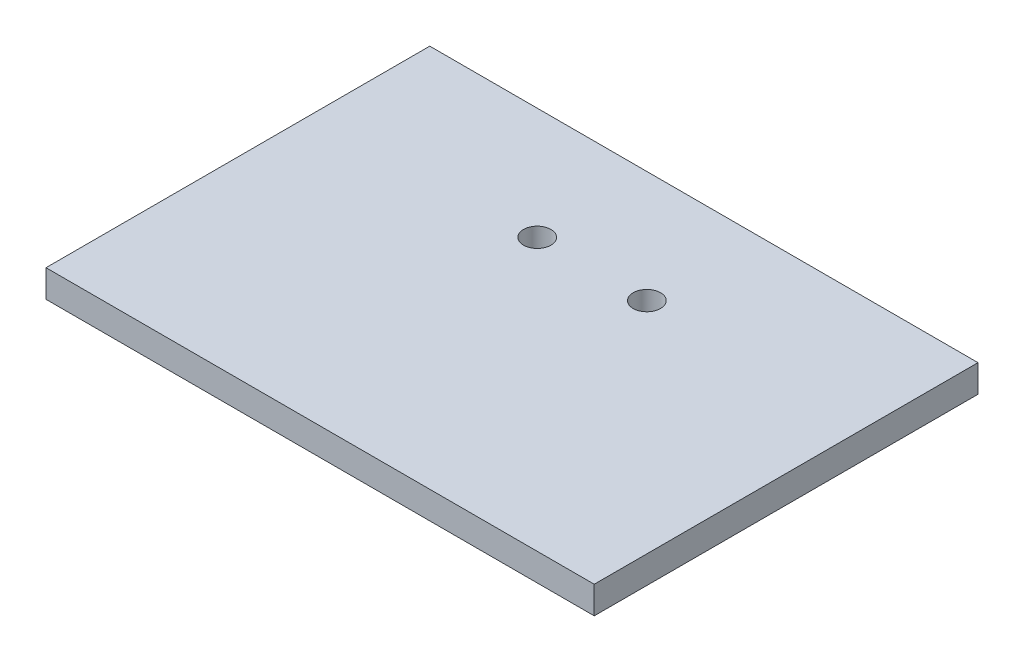
ISO-10303-21;
HEADER;
FILE_DESCRIPTION(('STEP AP214'),'2;1');
FILE_NAME('part.step','',(''),(''),'','','');
FILE_SCHEMA(('AUTOMOTIVE_DESIGN { 1 0 10303 214 1 1 1 1 }'));
ENDSEC;
DATA;
#1=APPLICATION_CONTEXT('core data for automotive mechanical design processes');
#2=APPLICATION_PROTOCOL_DEFINITION('international standard','automotive_design',2000,#1);
#3=PRODUCT_CONTEXT('',#1,'mechanical');
#4=PRODUCT('Part','Part','',(#3));
#5=PRODUCT_RELATED_PRODUCT_CATEGORY('part','',(#4));
#6=PRODUCT_DEFINITION_FORMATION('','',#4);
#7=PRODUCT_DEFINITION_CONTEXT('part definition',#1,'design');
#8=PRODUCT_DEFINITION('design','',#6,#7);
#9=PRODUCT_DEFINITION_SHAPE('','',#8);
#10=(LENGTH_UNIT() NAMED_UNIT(*) SI_UNIT(.MILLI.,.METRE.));
#11=(NAMED_UNIT(*) PLANE_ANGLE_UNIT() SI_UNIT($,.RADIAN.));
#12=(NAMED_UNIT(*) SI_UNIT($,.STERADIAN.) SOLID_ANGLE_UNIT());
#13=UNCERTAINTY_MEASURE_WITH_UNIT(LENGTH_MEASURE(1.E-05),#10,'distance_accuracy_value','');
#14=(GEOMETRIC_REPRESENTATION_CONTEXT(3) GLOBAL_UNCERTAINTY_ASSIGNED_CONTEXT((#13)) GLOBAL_UNIT_ASSIGNED_CONTEXT((#10,
#11,#12)) REPRESENTATION_CONTEXT('',''));
#15=CARTESIAN_POINT('',(0.,0.,0.));
#16=DIRECTION('',(0.,0.,1.));
#17=DIRECTION('',(1.,0.,0.));
#18=AXIS2_PLACEMENT_3D('',#15,#16,#17);
#19=CARTESIAN_POINT('',(0.,0.,44.45));
#20=DIRECTION('',(1.,0.,0.));
#21=DIRECTION('',(0.,0.,-1.));
#22=AXIS2_PLACEMENT_3D('',#19,#20,#21);
#23=PLANE('',#22);
#24=DIRECTION('',(0.,-1.,0.));
#25=VECTOR('',#24,1.);
#26=CARTESIAN_POINT('',(0.,0.,0.));
#27=LINE('',#26,#25);
#28=CARTESIAN_POINT('',(0.,3.175,0.));
#29=VERTEX_POINT('',#28);
#30=CARTESIAN_POINT('',(0.,0.,0.));
#31=VERTEX_POINT('',#30);
#32=EDGE_CURVE('E96',#29,#31,#27,.T.);
#33=ORIENTED_EDGE('',*,*,#32,.T.);
#34=DIRECTION('',(0.,0.,-1.));
#35=VECTOR('',#34,1.);
#36=CARTESIAN_POINT('',(0.,0.,44.45));
#37=LINE('',#36,#35);
#38=CARTESIAN_POINT('',(0.,0.,44.45));
#39=VERTEX_POINT('',#38);
#40=EDGE_CURVE('E11',#39,#31,#37,.T.);
#41=ORIENTED_EDGE('',*,*,#40,.F.);
#42=DIRECTION('',(0.,-1.,0.));
#43=VECTOR('',#42,1.);
#44=CARTESIAN_POINT('',(0.,0.,44.45));
#45=LINE('',#44,#43);
#46=CARTESIAN_POINT('',(0.,3.175,44.45));
#47=VERTEX_POINT('',#46);
#48=EDGE_CURVE('E84',#47,#39,#45,.T.);
#49=ORIENTED_EDGE('',*,*,#48,.F.);
#50=DIRECTION('',(0.,0.,-1.));
#51=VECTOR('',#50,1.);
#52=CARTESIAN_POINT('',(0.,3.175,44.45));
#53=LINE('',#52,#51);
#54=EDGE_CURVE('E92',#47,#29,#53,.T.);
#55=ORIENTED_EDGE('',*,*,#54,.T.);
#56=EDGE_LOOP('',(#33,#41,#49,#55));
#57=FACE_BOUND('',#56,.T.);
#58=ADVANCED_FACE('F33',(#57),#23,.F.);
#59=CARTESIAN_POINT('',(0.,0.,44.45));
#60=DIRECTION('',(0.,1.,0.));
#61=DIRECTION('',(0.,0.,1.));
#62=AXIS2_PLACEMENT_3D('',#59,#60,#61);
#63=PLANE('',#62);
#64=CARTESIAN_POINT('',(38.1,0.,12.954));
#65=DIRECTION('',(0.,1.,0.));
#66=DIRECTION('',(0.,0.,1.));
#67=AXIS2_PLACEMENT_3D('',#64,#65,#66);
#68=CIRCLE('',#67,1.5875);
#69=CARTESIAN_POINT('',(38.1,0.,14.5415));
#70=VERTEX_POINT('',#69);
#71=EDGE_CURVE('E113',#70,#70,#68,.T.);
#72=ORIENTED_EDGE('',*,*,#71,.T.);
#73=EDGE_LOOP('',(#72));
#74=FACE_BOUND('',#73,.T.);
#75=CARTESIAN_POINT('',(25.4,0.,12.954));
#76=DIRECTION('',(0.,1.,0.));
#77=DIRECTION('',(0.,0.,1.));
#78=AXIS2_PLACEMENT_3D('',#75,#76,#77);
#79=CIRCLE('',#78,1.5875);
#80=CARTESIAN_POINT('',(25.4,0.,14.5415));
#81=VERTEX_POINT('',#80);
#82=EDGE_CURVE('E99',#81,#81,#79,.T.);
#83=ORIENTED_EDGE('',*,*,#82,.T.);
#84=EDGE_LOOP('',(#83));
#85=FACE_BOUND('',#84,.T.);
#86=DIRECTION('',(1.,0.,0.));
#87=VECTOR('',#86,1.);
#88=CARTESIAN_POINT('',(0.,0.,0.));
#89=LINE('',#88,#87);
#90=CARTESIAN_POINT('',(63.5,0.,0.));
#91=VERTEX_POINT('',#90);
#92=EDGE_CURVE('E88',#31,#91,#89,.T.);
#93=ORIENTED_EDGE('',*,*,#92,.T.);
#94=DIRECTION('',(0.,0.,-1.));
#95=VECTOR('',#94,1.);
#96=CARTESIAN_POINT('',(63.5,0.,44.45));
#97=LINE('',#96,#95);
#98=CARTESIAN_POINT('',(63.5,0.,44.45));
#99=VERTEX_POINT('',#98);
#100=EDGE_CURVE('E41',#99,#91,#97,.T.);
#101=ORIENTED_EDGE('',*,*,#100,.F.);
#102=DIRECTION('',(1.,0.,0.));
#103=VECTOR('',#102,1.);
#104=CARTESIAN_POINT('',(0.,0.,44.45));
#105=LINE('',#104,#103);
#106=EDGE_CURVE('E79',#39,#99,#105,.T.);
#107=ORIENTED_EDGE('',*,*,#106,.F.);
#108=ORIENTED_EDGE('',*,*,#40,.T.);
#109=EDGE_LOOP('',(#93,#101,#107,#108));
#110=FACE_BOUND('',#109,.T.);
#111=ADVANCED_FACE('F87',(#74,#85,#110),#63,.F.);
#112=CARTESIAN_POINT('',(63.5,0.,44.45));
#113=DIRECTION('',(-1.,0.,0.));
#114=DIRECTION('',(0.,0.,1.));
#115=AXIS2_PLACEMENT_3D('',#112,#113,#114);
#116=PLANE('',#115);
#117=DIRECTION('',(0.,1.,0.));
#118=VECTOR('',#117,1.);
#119=CARTESIAN_POINT('',(63.5,0.,0.));
#120=LINE('',#119,#118);
#121=CARTESIAN_POINT('',(63.5,3.175,0.));
#122=VERTEX_POINT('',#121);
#123=EDGE_CURVE('E66',#91,#122,#120,.T.);
#124=ORIENTED_EDGE('',*,*,#123,.T.);
#125=DIRECTION('',(0.,0.,-1.));
#126=VECTOR('',#125,1.);
#127=CARTESIAN_POINT('',(63.5,3.175,44.45));
#128=LINE('',#127,#126);
#129=CARTESIAN_POINT('',(63.5,3.175,44.45));
#130=VERTEX_POINT('',#129);
#131=EDGE_CURVE('E89',#130,#122,#128,.T.);
#132=ORIENTED_EDGE('',*,*,#131,.F.);
#133=DIRECTION('',(0.,1.,0.));
#134=VECTOR('',#133,1.);
#135=CARTESIAN_POINT('',(63.5,0.,44.45));
#136=LINE('',#135,#134);
#137=EDGE_CURVE('E82',#99,#130,#136,.T.);
#138=ORIENTED_EDGE('',*,*,#137,.F.);
#139=ORIENTED_EDGE('',*,*,#100,.T.);
#140=EDGE_LOOP('',(#124,#132,#138,#139));
#141=FACE_BOUND('',#140,.T.);
#142=ADVANCED_FACE('F90',(#141),#116,.F.);
#143=CARTESIAN_POINT('',(0.,3.175,44.45));
#144=DIRECTION('',(0.,-1.,0.));
#145=DIRECTION('',(0.,0.,-1.));
#146=AXIS2_PLACEMENT_3D('',#143,#144,#145);
#147=PLANE('',#146);
#148=CARTESIAN_POINT('',(38.1,3.175,12.954));
#149=DIRECTION('',(0.,1.,0.));
#150=DIRECTION('',(0.,0.,1.));
#151=AXIS2_PLACEMENT_3D('',#148,#149,#150);
#152=CIRCLE('',#151,1.5875);
#153=CARTESIAN_POINT('',(38.1,3.175,14.5415));
#154=VERTEX_POINT('',#153);
#155=EDGE_CURVE('E116',#154,#154,#152,.T.);
#156=ORIENTED_EDGE('',*,*,#155,.F.);
#157=EDGE_LOOP('',(#156));
#158=FACE_BOUND('',#157,.T.);
#159=CARTESIAN_POINT('',(25.4,3.175,12.954));
#160=DIRECTION('',(0.,1.,0.));
#161=DIRECTION('',(0.,0.,1.));
#162=AXIS2_PLACEMENT_3D('',#159,#160,#161);
#163=CIRCLE('',#162,1.5875);
#164=CARTESIAN_POINT('',(25.4,3.175,14.5415));
#165=VERTEX_POINT('',#164);
#166=EDGE_CURVE('E110',#165,#165,#163,.T.);
#167=ORIENTED_EDGE('',*,*,#166,.F.);
#168=EDGE_LOOP('',(#167));
#169=FACE_BOUND('',#168,.T.);
#170=DIRECTION('',(-1.,0.,0.));
#171=VECTOR('',#170,1.);
#172=CARTESIAN_POINT('',(0.,3.175,0.));
#173=LINE('',#172,#171);
#174=EDGE_CURVE('E72',#122,#29,#173,.T.);
#175=ORIENTED_EDGE('',*,*,#174,.T.);
#176=ORIENTED_EDGE('',*,*,#54,.F.);
#177=DIRECTION('',(-1.,0.,0.));
#178=VECTOR('',#177,1.);
#179=CARTESIAN_POINT('',(0.,3.175,44.45));
#180=LINE('',#179,#178);
#181=EDGE_CURVE('E49',#130,#47,#180,.T.);
#182=ORIENTED_EDGE('',*,*,#181,.F.);
#183=ORIENTED_EDGE('',*,*,#131,.T.);
#184=EDGE_LOOP('',(#175,#176,#182,#183));
#185=FACE_BOUND('',#184,.T.);
#186=ADVANCED_FACE('F104',(#158,#169,#185),#147,.F.);
#187=CARTESIAN_POINT('',(0.,0.,44.45));
#188=DIRECTION('',(0.,0.,-1.));
#189=DIRECTION('',(-1.,0.,0.));
#190=AXIS2_PLACEMENT_3D('',#187,#188,#189);
#191=PLANE('',#190);
#192=ORIENTED_EDGE('',*,*,#48,.T.);
#193=ORIENTED_EDGE('',*,*,#106,.T.);
#194=ORIENTED_EDGE('',*,*,#137,.T.);
#195=ORIENTED_EDGE('',*,*,#181,.T.);
#196=EDGE_LOOP('',(#192,#193,#194,#195));
#197=FACE_BOUND('',#196,.T.);
#198=ADVANCED_FACE('F80',(#197),#191,.F.);
#199=CARTESIAN_POINT('',(0.,0.,0.));
#200=DIRECTION('',(0.,0.,-1.));
#201=DIRECTION('',(-1.,0.,0.));
#202=AXIS2_PLACEMENT_3D('',#199,#200,#201);
#203=PLANE('',#202);
#204=ORIENTED_EDGE('',*,*,#32,.F.);
#205=ORIENTED_EDGE('',*,*,#174,.F.);
#206=ORIENTED_EDGE('',*,*,#123,.F.);
#207=ORIENTED_EDGE('',*,*,#92,.F.);
#208=EDGE_LOOP('',(#204,#205,#206,#207));
#209=FACE_BOUND('',#208,.T.);
#210=ADVANCED_FACE('F107',(#209),#203,.T.);
#211=CARTESIAN_POINT('',(25.4,0.,12.954));
#212=DIRECTION('',(0.,1.,0.));
#213=DIRECTION('',(0.,0.,1.));
#214=AXIS2_PLACEMENT_3D('',#211,#212,#213);
#215=CYLINDRICAL_SURFACE('',#214,1.5875);
#216=ORIENTED_EDGE('',*,*,#82,.F.);
#217=EDGE_LOOP('',(#216));
#218=FACE_BOUND('',#217,.T.);
#219=ORIENTED_EDGE('',*,*,#166,.T.);
#220=EDGE_LOOP('',(#219));
#221=FACE_BOUND('',#220,.T.);
#222=ADVANCED_FACE('F127',(#218,#221),#215,.F.);
#223=CARTESIAN_POINT('',(38.1,0.,12.954));
#224=DIRECTION('',(0.,1.,0.));
#225=DIRECTION('',(0.,0.,1.));
#226=AXIS2_PLACEMENT_3D('',#223,#224,#225);
#227=CYLINDRICAL_SURFACE('',#226,1.5875);
#228=ORIENTED_EDGE('',*,*,#71,.F.);
#229=EDGE_LOOP('',(#228));
#230=FACE_BOUND('',#229,.T.);
#231=ORIENTED_EDGE('',*,*,#155,.T.);
#232=EDGE_LOOP('',(#231));
#233=FACE_BOUND('',#232,.T.);
#234=ADVANCED_FACE('F124',(#230,#233),#227,.F.);
#235=CLOSED_SHELL('',(#58,#111,#142,#186,#198,#210,#222,#234));
#236=MANIFOLD_SOLID_BREP('B2',#235);
#237=ADVANCED_BREP_SHAPE_REPRESENTATION('',(#18,#236),#14);
#238=SHAPE_DEFINITION_REPRESENTATION(#9,#237);
ENDSEC;
END-ISO-10303-21;
